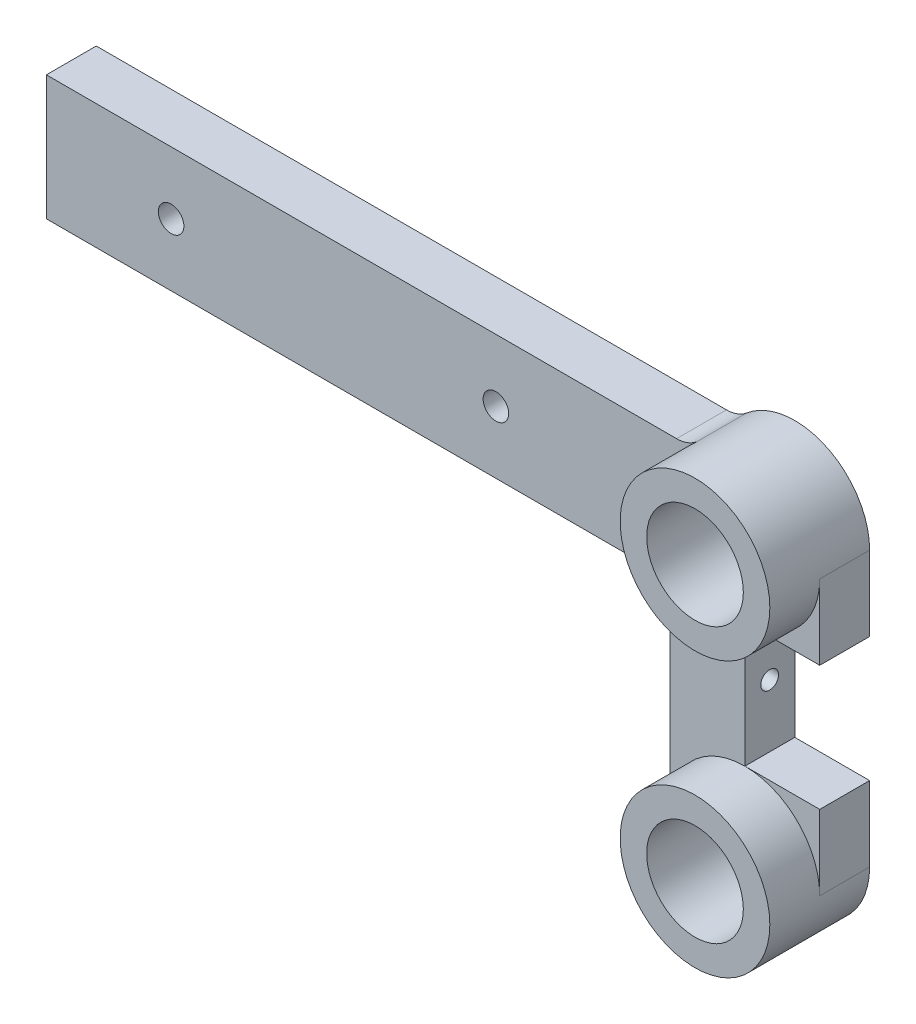
ISO-10303-21;
HEADER;
FILE_DESCRIPTION(('STEP AP214'),'2;1');
FILE_NAME('part.step','',(''),(''),'','','');
FILE_SCHEMA(('AUTOMOTIVE_DESIGN { 1 0 10303 214 1 1 1 1 }'));
ENDSEC;
DATA;
#1=APPLICATION_CONTEXT('core data for automotive mechanical design processes');
#2=APPLICATION_PROTOCOL_DEFINITION('international standard','automotive_design',2000,#1);
#3=PRODUCT_CONTEXT('',#1,'mechanical');
#4=PRODUCT('Part','Part','',(#3));
#5=PRODUCT_RELATED_PRODUCT_CATEGORY('part','',(#4));
#6=PRODUCT_DEFINITION_FORMATION('','',#4);
#7=PRODUCT_DEFINITION_CONTEXT('part definition',#1,'design');
#8=PRODUCT_DEFINITION('design','',#6,#7);
#9=PRODUCT_DEFINITION_SHAPE('','',#8);
#10=(LENGTH_UNIT() NAMED_UNIT(*) SI_UNIT(.MILLI.,.METRE.));
#11=(NAMED_UNIT(*) PLANE_ANGLE_UNIT() SI_UNIT($,.RADIAN.));
#12=(NAMED_UNIT(*) SI_UNIT($,.STERADIAN.) SOLID_ANGLE_UNIT());
#13=UNCERTAINTY_MEASURE_WITH_UNIT(LENGTH_MEASURE(1.E-05),#10,'distance_accuracy_value','');
#14=(GEOMETRIC_REPRESENTATION_CONTEXT(3) GLOBAL_UNCERTAINTY_ASSIGNED_CONTEXT((#13)) GLOBAL_UNIT_ASSIGNED_CONTEXT((#10,
#11,#12)) REPRESENTATION_CONTEXT('',''));
#15=CARTESIAN_POINT('',(0.,0.,0.));
#16=DIRECTION('',(0.,0.,1.));
#17=DIRECTION('',(1.,0.,0.));
#18=AXIS2_PLACEMENT_3D('',#15,#16,#17);
#19=CARTESIAN_POINT('',(0.,44.0000001788139,8.));
#20=DIRECTION('',(0.,0.,1.));
#21=DIRECTION('',(1.,0.,0.));
#22=AXIS2_PLACEMENT_3D('',#19,#20,#21);
#23=PLANE('',#22);
#24=CARTESIAN_POINT('',(-39.9238068438474,42.,8.));
#25=DIRECTION('',(0.,0.,1.));
#26=DIRECTION('',(1.,0.,0.));
#27=AXIS2_PLACEMENT_3D('',#24,#25,#26);
#28=CIRCLE('',#27,2.04999999999998);
#29=CARTESIAN_POINT('',(-37.8738068438474,42.,8.));
#30=VERTEX_POINT('',#29);
#31=EDGE_CURVE('E378',#30,#30,#28,.T.);
#32=ORIENTED_EDGE('',*,*,#31,.F.);
#33=EDGE_LOOP('',(#32));
#34=FACE_BOUND('',#33,.T.);
#35=CARTESIAN_POINT('',(-92.,42.,8.));
#36=DIRECTION('',(0.,0.,1.));
#37=DIRECTION('',(1.,0.,0.));
#38=AXIS2_PLACEMENT_3D('',#35,#36,#37);
#39=CIRCLE('',#38,2.04999999999998);
#40=CARTESIAN_POINT('',(-89.95,42.,8.));
#41=VERTEX_POINT('',#40);
#42=EDGE_CURVE('E390',#41,#41,#39,.T.);
#43=ORIENTED_EDGE('',*,*,#42,.F.);
#44=EDGE_LOOP('',(#43));
#45=FACE_BOUND('',#44,.T.);
#46=DIRECTION('',(-1.,0.,0.));
#47=VECTOR('',#46,1.);
#48=CARTESIAN_POINT('',(-7.,32.,8.));
#49=LINE('',#48,#47);
#50=CARTESIAN_POINT('',(-17.,32.,8.));
#51=VERTEX_POINT('',#50);
#52=CARTESIAN_POINT('',(-112.,32.,8.));
#53=VERTEX_POINT('',#52);
#54=EDGE_CURVE('E189',#51,#53,#49,.T.);
#55=ORIENTED_EDGE('',*,*,#54,.F.);
#56=CARTESIAN_POINT('',(-17.,27.,8.));
#57=DIRECTION('',(0.,0.,1.));
#58=DIRECTION('',(1.,0.,0.));
#59=AXIS2_PLACEMENT_3D('',#56,#57,#58);
#60=CIRCLE('',#59,5.);
#61=CARTESIAN_POINT('',(-12.,27.,8.));
#62=VERTEX_POINT('',#61);
#63=EDGE_CURVE('E45',#51,#62,#60,.F.);
#64=ORIENTED_EDGE('',*,*,#63,.T.);
#65=DIRECTION('',(0.,-1.,0.));
#66=VECTOR('',#65,1.);
#67=CARTESIAN_POINT('',(-12.,44.0000001788139,8.));
#68=LINE('',#67,#66);
#69=CARTESIAN_POINT('',(-12.,0.,8.));
#70=VERTEX_POINT('',#69);
#71=EDGE_CURVE('E141',#62,#70,#68,.T.);
#72=ORIENTED_EDGE('',*,*,#71,.T.);
#73=CARTESIAN_POINT('',(0.,0.,8.));
#74=DIRECTION('',(0.,0.,1.));
#75=DIRECTION('',(1.,0.,0.));
#76=AXIS2_PLACEMENT_3D('',#73,#74,#75);
#77=CIRCLE('',#76,12.);
#78=CARTESIAN_POINT('',(0.,12.,8.));
#79=VERTEX_POINT('',#78);
#80=EDGE_CURVE('E157',#79,#70,#77,.T.);
#81=ORIENTED_EDGE('',*,*,#80,.F.);
#82=DIRECTION('',(0.,1.,0.));
#83=VECTOR('',#82,1.);
#84=CARTESIAN_POINT('',(0.,12.,8.));
#85=LINE('',#84,#83);
#86=CARTESIAN_POINT('',(0.,32.,8.));
#87=VERTEX_POINT('',#86);
#88=EDGE_CURVE('E215',#79,#87,#85,.T.);
#89=ORIENTED_EDGE('',*,*,#88,.T.);
#90=CARTESIAN_POINT('',(0.,44.,8.));
#91=DIRECTION('',(0.,0.,1.));
#92=DIRECTION('',(1.,0.,0.));
#93=AXIS2_PLACEMENT_3D('',#90,#91,#92);
#94=CIRCLE('',#93,12.);
#95=CARTESIAN_POINT('',(-7.73255381469284,53.1764705362617,8.));
#96=VERTEX_POINT('',#95);
#97=EDGE_CURVE('E168',#96,#87,#94,.T.);
#98=ORIENTED_EDGE('',*,*,#97,.F.);
#99=CARTESIAN_POINT('',(-10.9544513623075,57.,8.));
#100=DIRECTION('',(0.,0.,1.));
#101=DIRECTION('',(1.,0.,0.));
#102=AXIS2_PLACEMENT_3D('',#99,#100,#101);
#103=CIRCLE('',#102,5.);
#104=CARTESIAN_POINT('',(-10.9544513623075,52.,8.));
#105=VERTEX_POINT('',#104);
#106=EDGE_CURVE('E247',#96,#105,#103,.F.);
#107=ORIENTED_EDGE('',*,*,#106,.T.);
#108=DIRECTION('',(-1.,0.,0.));
#109=VECTOR('',#108,1.);
#110=CARTESIAN_POINT('',(-7.,52.,8.));
#111=LINE('',#110,#109);
#112=CARTESIAN_POINT('',(-112.,52.,8.));
#113=VERTEX_POINT('',#112);
#114=EDGE_CURVE('E187',#105,#113,#111,.T.);
#115=ORIENTED_EDGE('',*,*,#114,.T.);
#116=DIRECTION('',(0.,1.,0.));
#117=VECTOR('',#116,1.);
#118=CARTESIAN_POINT('',(-112.,52.,8.));
#119=LINE('',#118,#117);
#120=EDGE_CURVE('E178',#53,#113,#119,.T.);
#121=ORIENTED_EDGE('',*,*,#120,.F.);
#122=EDGE_LOOP('',(#55,#64,#72,#81,#89,#98,#107,#115,#121));
#123=FACE_BOUND('',#122,.T.);
#124=ADVANCED_FACE('F37',(#34,#45,#123),#23,.T.);
#125=DIRECTION('',(-1.,0.,0.));
#126=VECTOR('',#125,1.);
#127=CARTESIAN_POINT('',(12.,12.,8.));
#128=LINE('',#127,#126);
#129=CARTESIAN_POINT('',(12.,12.,8.));
#130=VERTEX_POINT('',#129);
#131=EDGE_CURVE('E140',#130,#79,#128,.T.);
#132=ORIENTED_EDGE('',*,*,#131,.T.);
#133=CARTESIAN_POINT('',(12.,0.,8.));
#134=VERTEX_POINT('',#133);
#135=EDGE_CURVE('E149',#134,#79,#77,.T.);
#136=ORIENTED_EDGE('',*,*,#135,.F.);
#137=DIRECTION('',(0.,1.,0.));
#138=VECTOR('',#137,1.);
#139=CARTESIAN_POINT('',(12.,0.,8.));
#140=LINE('',#139,#138);
#141=EDGE_CURVE('E129',#134,#130,#140,.T.);
#142=ORIENTED_EDGE('',*,*,#141,.T.);
#143=EDGE_LOOP('',(#132,#136,#142));
#144=FACE_BOUND('',#143,.T.);
#145=ADVANCED_FACE('F155',(#144),#23,.T.);
#146=CARTESIAN_POINT('',(0.,44.0000001788139,0.));
#147=DIRECTION('',(0.,0.,1.));
#148=DIRECTION('',(1.,0.,0.));
#149=AXIS2_PLACEMENT_3D('',#146,#147,#148);
#150=CYLINDRICAL_SURFACE('',#149,12.);
#151=CARTESIAN_POINT('',(0.,44.0000001788139,0.));
#152=DIRECTION('',(0.,0.,1.));
#153=DIRECTION('',(1.,0.,0.));
#154=AXIS2_PLACEMENT_3D('',#151,#152,#153);
#155=CIRCLE('',#154,12.);
#156=CARTESIAN_POINT('',(12.,44.0000001788139,0.));
#157=VERTEX_POINT('',#156);
#158=CARTESIAN_POINT('',(-7.73255390280533,53.1764706408276,0.));
#159=VERTEX_POINT('',#158);
#160=EDGE_CURVE('E192',#157,#159,#155,.T.);
#161=ORIENTED_EDGE('',*,*,#160,.T.);
#162=DIRECTION('',(0.,0.,1.));
#163=VECTOR('',#162,1.);
#164=CARTESIAN_POINT('',(-7.73255390280533,53.1764706408276,0.));
#165=LINE('',#164,#163);
#166=EDGE_CURVE('E238',#159,#96,#165,.T.);
#167=ORIENTED_EDGE('',*,*,#166,.T.);
#168=ORIENTED_EDGE('',*,*,#97,.T.);
#169=CARTESIAN_POINT('',(12.,44.,8.));
#170=VERTEX_POINT('',#169);
#171=EDGE_CURVE('E172',#87,#170,#94,.T.);
#172=ORIENTED_EDGE('',*,*,#171,.T.);
#173=DIRECTION('',(0.,0.,1.));
#174=VECTOR('',#173,1.);
#175=CARTESIAN_POINT('',(12.,44.0000001788139,0.));
#176=LINE('',#175,#174);
#177=EDGE_CURVE('E222',#157,#170,#176,.T.);
#178=ORIENTED_EDGE('',*,*,#177,.F.);
#179=EDGE_LOOP('',(#161,#167,#168,#172,#178));
#180=FACE_BOUND('',#179,.T.);
#181=CARTESIAN_POINT('',(0.,44.,16.));
#182=DIRECTION('',(0.,0.,1.));
#183=DIRECTION('',(1.,0.,0.));
#184=AXIS2_PLACEMENT_3D('',#181,#182,#183);
#185=CIRCLE('',#184,12.);
#186=CARTESIAN_POINT('',(12.,44.,16.));
#187=VERTEX_POINT('',#186);
#188=EDGE_CURVE('E160',#187,#187,#185,.T.);
#189=ORIENTED_EDGE('',*,*,#188,.F.);
#190=EDGE_LOOP('',(#189));
#191=FACE_BOUND('',#190,.T.);
#192=ADVANCED_FACE('F265',(#180,#191),#150,.T.);
#193=CARTESIAN_POINT('',(12.,32.,0.));
#194=DIRECTION('',(1.,0.,0.));
#195=DIRECTION('',(0.,1.,0.));
#196=AXIS2_PLACEMENT_3D('',#193,#194,#195);
#197=PLANE('',#196);
#198=DIRECTION('',(0.,1.,0.));
#199=VECTOR('',#198,1.);
#200=CARTESIAN_POINT('',(12.,32.,8.));
#201=LINE('',#200,#199);
#202=CARTESIAN_POINT('',(12.,32.,8.));
#203=VERTEX_POINT('',#202);
#204=EDGE_CURVE('E196',#203,#170,#201,.T.);
#205=ORIENTED_EDGE('',*,*,#204,.F.);
#206=DIRECTION('',(0.,0.,1.));
#207=VECTOR('',#206,1.);
#208=CARTESIAN_POINT('',(12.,32.,0.));
#209=LINE('',#208,#207);
#210=CARTESIAN_POINT('',(12.,32.,0.));
#211=VERTEX_POINT('',#210);
#212=EDGE_CURVE('E225',#211,#203,#209,.T.);
#213=ORIENTED_EDGE('',*,*,#212,.F.);
#214=DIRECTION('',(0.,1.,0.));
#215=VECTOR('',#214,1.);
#216=CARTESIAN_POINT('',(12.,32.,0.));
#217=LINE('',#216,#215);
#218=EDGE_CURVE('E210',#211,#157,#217,.T.);
#219=ORIENTED_EDGE('',*,*,#218,.T.);
#220=ORIENTED_EDGE('',*,*,#177,.T.);
#221=EDGE_LOOP('',(#205,#213,#219,#220));
#222=FACE_BOUND('',#221,.T.);
#223=ADVANCED_FACE('F270',(#222),#197,.T.);
#224=CARTESIAN_POINT('',(0.,32.,0.));
#225=DIRECTION('',(0.,-1.,0.));
#226=DIRECTION('',(0.,0.,-1.));
#227=AXIS2_PLACEMENT_3D('',#224,#225,#226);
#228=PLANE('',#227);
#229=DIRECTION('',(1.,0.,0.));
#230=VECTOR('',#229,1.);
#231=CARTESIAN_POINT('',(0.,32.,8.));
#232=LINE('',#231,#230);
#233=EDGE_CURVE('E218',#87,#203,#232,.T.);
#234=ORIENTED_EDGE('',*,*,#233,.F.);
#235=DIRECTION('',(0.,0.,1.));
#236=VECTOR('',#235,1.);
#237=CARTESIAN_POINT('',(0.,32.,0.));
#238=LINE('',#237,#236);
#239=CARTESIAN_POINT('',(0.,32.,0.));
#240=VERTEX_POINT('',#239);
#241=EDGE_CURVE('E227',#240,#87,#238,.T.);
#242=ORIENTED_EDGE('',*,*,#241,.F.);
#243=DIRECTION('',(1.,0.,0.));
#244=VECTOR('',#243,1.);
#245=CARTESIAN_POINT('',(0.,32.,0.));
#246=LINE('',#245,#244);
#247=EDGE_CURVE('E207',#240,#211,#246,.T.);
#248=ORIENTED_EDGE('',*,*,#247,.T.);
#249=ORIENTED_EDGE('',*,*,#212,.T.);
#250=EDGE_LOOP('',(#234,#242,#248,#249));
#251=FACE_BOUND('',#250,.T.);
#252=ADVANCED_FACE('F321',(#251),#228,.T.);
#253=CARTESIAN_POINT('',(0.,12.,0.));
#254=DIRECTION('',(1.,0.,0.));
#255=DIRECTION('',(0.,1.,0.));
#256=AXIS2_PLACEMENT_3D('',#253,#254,#255);
#257=PLANE('',#256);
#258=CARTESIAN_POINT('',(0.,22.,4.02999031281051));
#259=DIRECTION('',(1.,0.,0.));
#260=DIRECTION('',(0.,0.,-1.));
#261=AXIS2_PLACEMENT_3D('',#258,#259,#260);
#262=CIRCLE('',#261,1.42499999999999);
#263=CARTESIAN_POINT('',(0.,22.,2.60499031281052));
#264=VERTEX_POINT('',#263);
#265=EDGE_CURVE('E405',#264,#264,#262,.T.);
#266=ORIENTED_EDGE('',*,*,#265,.F.);
#267=EDGE_LOOP('',(#266));
#268=FACE_BOUND('',#267,.T.);
#269=ORIENTED_EDGE('',*,*,#88,.F.);
#270=DIRECTION('',(0.,0.,1.));
#271=VECTOR('',#270,1.);
#272=CARTESIAN_POINT('',(0.,12.,0.));
#273=LINE('',#272,#271);
#274=CARTESIAN_POINT('',(0.,12.,0.));
#275=VERTEX_POINT('',#274);
#276=EDGE_CURVE('E230',#275,#79,#273,.T.);
#277=ORIENTED_EDGE('',*,*,#276,.F.);
#278=DIRECTION('',(0.,1.,0.));
#279=VECTOR('',#278,1.);
#280=CARTESIAN_POINT('',(0.,12.,0.));
#281=LINE('',#280,#279);
#282=EDGE_CURVE('E204',#275,#240,#281,.T.);
#283=ORIENTED_EDGE('',*,*,#282,.T.);
#284=ORIENTED_EDGE('',*,*,#241,.T.);
#285=EDGE_LOOP('',(#269,#277,#283,#284));
#286=FACE_BOUND('',#285,.T.);
#287=ADVANCED_FACE('F277',(#268,#286),#257,.T.);
#288=CARTESIAN_POINT('',(12.,12.,0.));
#289=DIRECTION('',(0.,1.,0.));
#290=DIRECTION('',(0.,0.,1.));
#291=AXIS2_PLACEMENT_3D('',#288,#289,#290);
#292=PLANE('',#291);
#293=ORIENTED_EDGE('',*,*,#131,.F.);
#294=DIRECTION('',(0.,0.,1.));
#295=VECTOR('',#294,1.);
#296=CARTESIAN_POINT('',(12.,12.,0.));
#297=LINE('',#296,#295);
#298=CARTESIAN_POINT('',(12.,12.,0.));
#299=VERTEX_POINT('',#298);
#300=EDGE_CURVE('E135',#299,#130,#297,.T.);
#301=ORIENTED_EDGE('',*,*,#300,.F.);
#302=DIRECTION('',(-1.,0.,0.));
#303=VECTOR('',#302,1.);
#304=CARTESIAN_POINT('',(12.,12.,0.));
#305=LINE('',#304,#303);
#306=EDGE_CURVE('E201',#299,#275,#305,.T.);
#307=ORIENTED_EDGE('',*,*,#306,.T.);
#308=ORIENTED_EDGE('',*,*,#276,.T.);
#309=EDGE_LOOP('',(#293,#301,#307,#308));
#310=FACE_BOUND('',#309,.T.);
#311=ADVANCED_FACE('F280',(#310),#292,.T.);
#312=CARTESIAN_POINT('',(12.,0.,0.));
#313=DIRECTION('',(1.,0.,0.));
#314=DIRECTION('',(0.,0.,-1.));
#315=AXIS2_PLACEMENT_3D('',#312,#313,#314);
#316=PLANE('',#315);
#317=ORIENTED_EDGE('',*,*,#141,.F.);
#318=DIRECTION('',(0.,0.,1.));
#319=VECTOR('',#318,1.);
#320=CARTESIAN_POINT('',(12.,0.,0.));
#321=LINE('',#320,#319);
#322=CARTESIAN_POINT('',(12.,0.,0.));
#323=VERTEX_POINT('',#322);
#324=EDGE_CURVE('E133',#323,#134,#321,.T.);
#325=ORIENTED_EDGE('',*,*,#324,.F.);
#326=DIRECTION('',(0.,1.,0.));
#327=VECTOR('',#326,1.);
#328=CARTESIAN_POINT('',(12.,0.,0.));
#329=LINE('',#328,#327);
#330=EDGE_CURVE('E199',#323,#299,#329,.T.);
#331=ORIENTED_EDGE('',*,*,#330,.T.);
#332=ORIENTED_EDGE('',*,*,#300,.T.);
#333=EDGE_LOOP('',(#317,#325,#331,#332));
#334=FACE_BOUND('',#333,.T.);
#335=ADVANCED_FACE('F131',(#334),#316,.T.);
#336=CARTESIAN_POINT('',(0.,0.,0.));
#337=DIRECTION('',(0.,0.,1.));
#338=DIRECTION('',(1.,0.,0.));
#339=AXIS2_PLACEMENT_3D('',#336,#337,#338);
#340=CYLINDRICAL_SURFACE('',#339,12.);
#341=ORIENTED_EDGE('',*,*,#324,.T.);
#342=ORIENTED_EDGE('',*,*,#135,.T.);
#343=ORIENTED_EDGE('',*,*,#80,.T.);
#344=DIRECTION('',(0.,0.,1.));
#345=VECTOR('',#344,1.);
#346=CARTESIAN_POINT('',(-12.,0.,0.));
#347=LINE('',#346,#345);
#348=CARTESIAN_POINT('',(-12.,0.,0.));
#349=VERTEX_POINT('',#348);
#350=EDGE_CURVE('E153',#349,#70,#347,.T.);
#351=ORIENTED_EDGE('',*,*,#350,.F.);
#352=CARTESIAN_POINT('',(0.,0.,0.));
#353=DIRECTION('',(0.,0.,1.));
#354=DIRECTION('',(1.,0.,0.));
#355=AXIS2_PLACEMENT_3D('',#352,#353,#354);
#356=CIRCLE('',#355,12.);
#357=EDGE_CURVE('E152',#349,#323,#356,.T.);
#358=ORIENTED_EDGE('',*,*,#357,.T.);
#359=EDGE_LOOP('',(#341,#342,#343,#351,#358));
#360=FACE_BOUND('',#359,.T.);
#361=CARTESIAN_POINT('',(0.,0.,16.));
#362=DIRECTION('',(0.,0.,1.));
#363=DIRECTION('',(1.,0.,0.));
#364=AXIS2_PLACEMENT_3D('',#361,#362,#363);
#365=CIRCLE('',#364,12.);
#366=CARTESIAN_POINT('',(12.,0.,16.));
#367=VERTEX_POINT('',#366);
#368=EDGE_CURVE('E156',#367,#367,#365,.T.);
#369=ORIENTED_EDGE('',*,*,#368,.F.);
#370=EDGE_LOOP('',(#369));
#371=FACE_BOUND('',#370,.T.);
#372=ADVANCED_FACE('F146',(#360,#371),#340,.T.);
#373=CARTESIAN_POINT('',(-12.,44.0000001788139,0.));
#374=DIRECTION('',(-1.,0.,0.));
#375=DIRECTION('',(0.,0.,1.));
#376=AXIS2_PLACEMENT_3D('',#373,#374,#375);
#377=PLANE('',#376);
#378=ORIENTED_EDGE('',*,*,#71,.F.);
#379=DIRECTION('',(0.,0.,1.));
#380=VECTOR('',#379,1.);
#381=CARTESIAN_POINT('',(-12.,27.,0.));
#382=LINE('',#381,#380);
#383=CARTESIAN_POINT('',(-12.,27.,0.));
#384=VERTEX_POINT('',#383);
#385=EDGE_CURVE('E58',#62,#384,#382,.F.);
#386=ORIENTED_EDGE('',*,*,#385,.T.);
#387=DIRECTION('',(0.,-1.,0.));
#388=VECTOR('',#387,1.);
#389=CARTESIAN_POINT('',(-12.,44.0000001788139,0.));
#390=LINE('',#389,#388);
#391=EDGE_CURVE('E195',#384,#349,#390,.T.);
#392=ORIENTED_EDGE('',*,*,#391,.T.);
#393=ORIENTED_EDGE('',*,*,#350,.T.);
#394=EDGE_LOOP('',(#378,#386,#392,#393));
#395=FACE_BOUND('',#394,.T.);
#396=ADVANCED_FACE('F319',(#395),#377,.T.);
#397=CARTESIAN_POINT('',(0.,44.0000001788139,0.));
#398=DIRECTION('',(0.,0.,1.));
#399=DIRECTION('',(1.,0.,0.));
#400=AXIS2_PLACEMENT_3D('',#397,#398,#399);
#401=PLANE('',#400);
#402=CARTESIAN_POINT('',(0.,44.,0.));
#403=DIRECTION('',(0.,0.,1.));
#404=DIRECTION('',(1.,0.,0.));
#405=AXIS2_PLACEMENT_3D('',#402,#403,#404);
#406=CIRCLE('',#405,7.75);
#407=CARTESIAN_POINT('',(7.75,44.,0.));
#408=VERTEX_POINT('',#407);
#409=EDGE_CURVE('E375',#408,#408,#406,.T.);
#410=ORIENTED_EDGE('',*,*,#409,.T.);
#411=EDGE_LOOP('',(#410));
#412=FACE_BOUND('',#411,.T.);
#413=CARTESIAN_POINT('',(0.,0.,0.));
#414=DIRECTION('',(0.,0.,1.));
#415=DIRECTION('',(1.,0.,0.));
#416=AXIS2_PLACEMENT_3D('',#413,#414,#415);
#417=CIRCLE('',#416,7.75);
#418=CARTESIAN_POINT('',(7.75,0.,0.));
#419=VERTEX_POINT('',#418);
#420=EDGE_CURVE('E374',#419,#419,#417,.T.);
#421=ORIENTED_EDGE('',*,*,#420,.T.);
#422=EDGE_LOOP('',(#421));
#423=FACE_BOUND('',#422,.T.);
#424=CARTESIAN_POINT('',(-39.9238068438474,42.,0.));
#425=DIRECTION('',(0.,0.,1.));
#426=DIRECTION('',(1.,0.,0.));
#427=AXIS2_PLACEMENT_3D('',#424,#425,#426);
#428=CIRCLE('',#427,2.04999999999998);
#429=CARTESIAN_POINT('',(-37.8738068438474,42.,0.));
#430=VERTEX_POINT('',#429);
#431=EDGE_CURVE('E387',#430,#430,#428,.T.);
#432=ORIENTED_EDGE('',*,*,#431,.T.);
#433=EDGE_LOOP('',(#432));
#434=FACE_BOUND('',#433,.T.);
#435=CARTESIAN_POINT('',(-92.,42.,0.));
#436=DIRECTION('',(0.,0.,1.));
#437=DIRECTION('',(1.,0.,0.));
#438=AXIS2_PLACEMENT_3D('',#435,#436,#437);
#439=CIRCLE('',#438,2.04999999999998);
#440=CARTESIAN_POINT('',(-89.95,42.,0.));
#441=VERTEX_POINT('',#440);
#442=EDGE_CURVE('E162',#441,#441,#439,.T.);
#443=ORIENTED_EDGE('',*,*,#442,.T.);
#444=EDGE_LOOP('',(#443));
#445=FACE_BOUND('',#444,.T.);
#446=DIRECTION('',(-1.,0.,0.));
#447=VECTOR('',#446,1.);
#448=CARTESIAN_POINT('',(-7.,52.,0.));
#449=LINE('',#448,#447);
#450=CARTESIAN_POINT('',(-10.9544513623075,52.,0.));
#451=VERTEX_POINT('',#450);
#452=CARTESIAN_POINT('',(-112.,52.,0.));
#453=VERTEX_POINT('',#452);
#454=EDGE_CURVE('E185',#451,#453,#449,.T.);
#455=ORIENTED_EDGE('',*,*,#454,.F.);
#456=CARTESIAN_POINT('',(-10.9544513623075,57.,0.));
#457=DIRECTION('',(0.,0.,1.));
#458=DIRECTION('',(1.,0.,0.));
#459=AXIS2_PLACEMENT_3D('',#456,#457,#458);
#460=CIRCLE('',#459,5.);
#461=EDGE_CURVE('E245',#451,#159,#460,.T.);
#462=ORIENTED_EDGE('',*,*,#461,.T.);
#463=ORIENTED_EDGE('',*,*,#160,.F.);
#464=ORIENTED_EDGE('',*,*,#218,.F.);
#465=ORIENTED_EDGE('',*,*,#247,.F.);
#466=ORIENTED_EDGE('',*,*,#282,.F.);
#467=ORIENTED_EDGE('',*,*,#306,.F.);
#468=ORIENTED_EDGE('',*,*,#330,.F.);
#469=ORIENTED_EDGE('',*,*,#357,.F.);
#470=ORIENTED_EDGE('',*,*,#391,.F.);
#471=CARTESIAN_POINT('',(-17.,27.,0.));
#472=DIRECTION('',(0.,0.,1.));
#473=DIRECTION('',(1.,0.,0.));
#474=AXIS2_PLACEMENT_3D('',#471,#472,#473);
#475=CIRCLE('',#474,5.);
#476=CARTESIAN_POINT('',(-17.,32.,0.));
#477=VERTEX_POINT('',#476);
#478=EDGE_CURVE('E11',#384,#477,#475,.T.);
#479=ORIENTED_EDGE('',*,*,#478,.T.);
#480=DIRECTION('',(-1.,0.,0.));
#481=VECTOR('',#480,1.);
#482=CARTESIAN_POINT('',(-7.,32.,0.));
#483=LINE('',#482,#481);
#484=CARTESIAN_POINT('',(-112.,32.,0.));
#485=VERTEX_POINT('',#484);
#486=EDGE_CURVE('E184',#477,#485,#483,.T.);
#487=ORIENTED_EDGE('',*,*,#486,.T.);
#488=DIRECTION('',(0.,-1.,0.));
#489=VECTOR('',#488,1.);
#490=CARTESIAN_POINT('',(-112.,52.,0.));
#491=LINE('',#490,#489);
#492=EDGE_CURVE('E167',#453,#485,#491,.T.);
#493=ORIENTED_EDGE('',*,*,#492,.F.);
#494=EDGE_LOOP('',(#455,#462,#463,#464,#465,#466,#467,#468,#469,#470,#479,#487,#493));
#495=FACE_BOUND('',#494,.T.);
#496=ADVANCED_FACE('F261',(#412,#423,#434,#445,#495),#401,.F.);
#497=ORIENTED_EDGE('',*,*,#171,.F.);
#498=ORIENTED_EDGE('',*,*,#233,.T.);
#499=ORIENTED_EDGE('',*,*,#204,.T.);
#500=EDGE_LOOP('',(#497,#498,#499));
#501=FACE_BOUND('',#500,.T.);
#502=ADVANCED_FACE('F305',(#501),#23,.T.);
#503=CARTESIAN_POINT('',(-7.,52.,0.));
#504=DIRECTION('',(0.,1.,0.));
#505=DIRECTION('',(0.,0.,1.));
#506=AXIS2_PLACEMENT_3D('',#503,#504,#505);
#507=PLANE('',#506);
#508=ORIENTED_EDGE('',*,*,#114,.F.);
#509=DIRECTION('',(0.,0.,-1.));
#510=VECTOR('',#509,1.);
#511=CARTESIAN_POINT('',(-10.9544513623075,52.,0.));
#512=LINE('',#511,#510);
#513=EDGE_CURVE('E171',#105,#451,#512,.T.);
#514=ORIENTED_EDGE('',*,*,#513,.T.);
#515=ORIENTED_EDGE('',*,*,#454,.T.);
#516=DIRECTION('',(0.,0.,-1.));
#517=VECTOR('',#516,1.);
#518=CARTESIAN_POINT('',(-112.,52.,0.));
#519=LINE('',#518,#517);
#520=EDGE_CURVE('E181',#113,#453,#519,.T.);
#521=ORIENTED_EDGE('',*,*,#520,.F.);
#522=EDGE_LOOP('',(#508,#514,#515,#521));
#523=FACE_BOUND('',#522,.T.);
#524=ADVANCED_FACE('F256',(#523),#507,.T.);
#525=CARTESIAN_POINT('',(-7.,32.,0.));
#526=DIRECTION('',(0.,-1.,0.));
#527=DIRECTION('',(0.,0.,-1.));
#528=AXIS2_PLACEMENT_3D('',#525,#526,#527);
#529=PLANE('',#528);
#530=ORIENTED_EDGE('',*,*,#486,.F.);
#531=DIRECTION('',(0.,0.,1.));
#532=VECTOR('',#531,1.);
#533=CARTESIAN_POINT('',(-17.,32.,8.));
#534=LINE('',#533,#532);
#535=EDGE_CURVE('E241',#477,#51,#534,.T.);
#536=ORIENTED_EDGE('',*,*,#535,.T.);
#537=ORIENTED_EDGE('',*,*,#54,.T.);
#538=DIRECTION('',(0.,0.,1.));
#539=VECTOR('',#538,1.);
#540=CARTESIAN_POINT('',(-112.,32.,0.));
#541=LINE('',#540,#539);
#542=EDGE_CURVE('E175',#485,#53,#541,.T.);
#543=ORIENTED_EDGE('',*,*,#542,.F.);
#544=EDGE_LOOP('',(#530,#536,#537,#543));
#545=FACE_BOUND('',#544,.T.);
#546=ADVANCED_FACE('F286',(#545),#529,.T.);
#547=CARTESIAN_POINT('',(-112.,0.,0.));
#548=DIRECTION('',(-1.,0.,0.));
#549=DIRECTION('',(0.,0.,1.));
#550=AXIS2_PLACEMENT_3D('',#547,#548,#549);
#551=PLANE('',#550);
#552=ORIENTED_EDGE('',*,*,#492,.T.);
#553=ORIENTED_EDGE('',*,*,#542,.T.);
#554=ORIENTED_EDGE('',*,*,#120,.T.);
#555=ORIENTED_EDGE('',*,*,#520,.T.);
#556=EDGE_LOOP('',(#552,#553,#554,#555));
#557=FACE_BOUND('',#556,.T.);
#558=ADVANCED_FACE('F289',(#557),#551,.T.);
#559=CARTESIAN_POINT('',(0.,44.,16.));
#560=DIRECTION('',(0.,0.,1.));
#561=DIRECTION('',(1.,0.,0.));
#562=AXIS2_PLACEMENT_3D('',#559,#560,#561);
#563=PLANE('',#562);
#564=CARTESIAN_POINT('',(0.,44.,16.));
#565=DIRECTION('',(0.,0.,1.));
#566=DIRECTION('',(1.,0.,0.));
#567=AXIS2_PLACEMENT_3D('',#564,#565,#566);
#568=CIRCLE('',#567,7.74999999999999);
#569=CARTESIAN_POINT('',(7.74999999999999,44.,16.));
#570=VERTEX_POINT('',#569);
#571=EDGE_CURVE('E381',#570,#570,#568,.T.);
#572=ORIENTED_EDGE('',*,*,#571,.F.);
#573=EDGE_LOOP('',(#572));
#574=FACE_BOUND('',#573,.T.);
#575=ORIENTED_EDGE('',*,*,#188,.T.);
#576=EDGE_LOOP('',(#575));
#577=FACE_BOUND('',#576,.T.);
#578=ADVANCED_FACE('F291',(#574,#577),#563,.T.);
#579=CARTESIAN_POINT('',(0.,0.,16.));
#580=DIRECTION('',(0.,0.,1.));
#581=DIRECTION('',(1.,0.,0.));
#582=AXIS2_PLACEMENT_3D('',#579,#580,#581);
#583=PLANE('',#582);
#584=CARTESIAN_POINT('',(0.,0.,16.));
#585=DIRECTION('',(0.,0.,1.));
#586=DIRECTION('',(1.,0.,0.));
#587=AXIS2_PLACEMENT_3D('',#584,#585,#586);
#588=CIRCLE('',#587,7.74999999999999);
#589=CARTESIAN_POINT('',(7.74999999999999,0.,16.));
#590=VERTEX_POINT('',#589);
#591=EDGE_CURVE('E371',#590,#590,#588,.T.);
#592=ORIENTED_EDGE('',*,*,#591,.F.);
#593=EDGE_LOOP('',(#592));
#594=FACE_BOUND('',#593,.T.);
#595=ORIENTED_EDGE('',*,*,#368,.T.);
#596=EDGE_LOOP('',(#595));
#597=FACE_BOUND('',#596,.T.);
#598=ADVANCED_FACE('F297',(#594,#597),#583,.T.);
#599=CARTESIAN_POINT('',(-92.,42.,8.));
#600=DIRECTION('',(0.,0.,1.));
#601=DIRECTION('',(1.,0.,0.));
#602=AXIS2_PLACEMENT_3D('',#599,#600,#601);
#603=CYLINDRICAL_SURFACE('',#602,2.04999999999998);
#604=ORIENTED_EDGE('',*,*,#442,.F.);
#605=EDGE_LOOP('',(#604));
#606=FACE_BOUND('',#605,.T.);
#607=ORIENTED_EDGE('',*,*,#42,.T.);
#608=EDGE_LOOP('',(#607));
#609=FACE_BOUND('',#608,.T.);
#610=ADVANCED_FACE('F359',(#606,#609),#603,.F.);
#611=CARTESIAN_POINT('',(-39.9238068438474,42.,8.));
#612=DIRECTION('',(0.,0.,1.));
#613=DIRECTION('',(1.,0.,0.));
#614=AXIS2_PLACEMENT_3D('',#611,#612,#613);
#615=CYLINDRICAL_SURFACE('',#614,2.04999999999998);
#616=ORIENTED_EDGE('',*,*,#431,.F.);
#617=EDGE_LOOP('',(#616));
#618=FACE_BOUND('',#617,.T.);
#619=ORIENTED_EDGE('',*,*,#31,.T.);
#620=EDGE_LOOP('',(#619));
#621=FACE_BOUND('',#620,.T.);
#622=ADVANCED_FACE('F355',(#618,#621),#615,.F.);
#623=CARTESIAN_POINT('',(0.,0.,16.));
#624=DIRECTION('',(0.,0.,1.));
#625=DIRECTION('',(1.,0.,0.));
#626=AXIS2_PLACEMENT_3D('',#623,#624,#625);
#627=CYLINDRICAL_SURFACE('',#626,7.74999999999999);
#628=ORIENTED_EDGE('',*,*,#420,.F.);
#629=EDGE_LOOP('',(#628));
#630=FACE_BOUND('',#629,.T.);
#631=ORIENTED_EDGE('',*,*,#591,.T.);
#632=EDGE_LOOP('',(#631));
#633=FACE_BOUND('',#632,.T.);
#634=ADVANCED_FACE('F351',(#630,#633),#627,.F.);
#635=CARTESIAN_POINT('',(0.,44.,16.));
#636=DIRECTION('',(0.,0.,1.));
#637=DIRECTION('',(1.,0.,0.));
#638=AXIS2_PLACEMENT_3D('',#635,#636,#637);
#639=CYLINDRICAL_SURFACE('',#638,7.74999999999999);
#640=ORIENTED_EDGE('',*,*,#409,.F.);
#641=EDGE_LOOP('',(#640));
#642=FACE_BOUND('',#641,.T.);
#643=ORIENTED_EDGE('',*,*,#571,.T.);
#644=EDGE_LOOP('',(#643));
#645=FACE_BOUND('',#644,.T.);
#646=ADVANCED_FACE('F343',(#642,#645),#639,.F.);
#647=CARTESIAN_POINT('',(-9.99999999999999,22.,4.02999031281051));
#648=DIRECTION('',(-1.,0.,0.));
#649=DIRECTION('',(0.,0.,1.));
#650=AXIS2_PLACEMENT_3D('',#647,#648,#649);
#651=PLANE('',#650);
#652=CARTESIAN_POINT('',(-9.99999999999999,22.,4.02999031281051));
#653=DIRECTION('',(1.,0.,0.));
#654=DIRECTION('',(0.,0.,-1.));
#655=AXIS2_PLACEMENT_3D('',#652,#653,#654);
#656=CIRCLE('',#655,1.42499999999999);
#657=CARTESIAN_POINT('',(-9.99999999999999,22.,2.60499031281052));
#658=VERTEX_POINT('',#657);
#659=EDGE_CURVE('E402',#658,#658,#656,.T.);
#660=ORIENTED_EDGE('',*,*,#659,.T.);
#661=EDGE_LOOP('',(#660));
#662=FACE_BOUND('',#661,.T.);
#663=ADVANCED_FACE('F337',(#662),#651,.F.);
#664=CARTESIAN_POINT('',(0.,22.,4.02999031281051));
#665=DIRECTION('',(1.,0.,0.));
#666=DIRECTION('',(0.,0.,-1.));
#667=AXIS2_PLACEMENT_3D('',#664,#665,#666);
#668=CYLINDRICAL_SURFACE('',#667,1.42499999999999);
#669=ORIENTED_EDGE('',*,*,#659,.F.);
#670=EDGE_LOOP('',(#669));
#671=FACE_BOUND('',#670,.T.);
#672=ORIENTED_EDGE('',*,*,#265,.T.);
#673=EDGE_LOOP('',(#672));
#674=FACE_BOUND('',#673,.T.);
#675=ADVANCED_FACE('F332',(#671,#674),#668,.F.);
#676=CARTESIAN_POINT('',(-10.9544513623075,57.,0.));
#677=DIRECTION('',(0.,0.,1.));
#678=DIRECTION('',(1.,0.,0.));
#679=AXIS2_PLACEMENT_3D('',#676,#677,#678);
#680=CYLINDRICAL_SURFACE('',#679,5.);
#681=ORIENTED_EDGE('',*,*,#106,.F.);
#682=ORIENTED_EDGE('',*,*,#166,.F.);
#683=ORIENTED_EDGE('',*,*,#461,.F.);
#684=ORIENTED_EDGE('',*,*,#513,.F.);
#685=EDGE_LOOP('',(#681,#682,#683,#684));
#686=FACE_BOUND('',#685,.T.);
#687=ADVANCED_FACE('F258',(#686),#680,.F.);
#688=CARTESIAN_POINT('',(-17.,27.,0.));
#689=DIRECTION('',(0.,0.,-1.));
#690=DIRECTION('',(-1.,0.,0.));
#691=AXIS2_PLACEMENT_3D('',#688,#689,#690);
#692=CYLINDRICAL_SURFACE('',#691,5.);
#693=ORIENTED_EDGE('',*,*,#478,.F.);
#694=ORIENTED_EDGE('',*,*,#385,.F.);
#695=ORIENTED_EDGE('',*,*,#63,.F.);
#696=ORIENTED_EDGE('',*,*,#535,.F.);
#697=EDGE_LOOP('',(#693,#694,#695,#696));
#698=FACE_BOUND('',#697,.T.);
#699=ADVANCED_FACE('F39',(#698),#692,.F.);
#700=CLOSED_SHELL('',(#124,#145,#192,#223,#252,#287,#311,#335,#372,#396,#496,#502,#524,#546,
#558,#578,#598,#610,#622,#634,#646,#663,#675,#687,#699));
#701=MANIFOLD_SOLID_BREP('B2',#700);
#702=ADVANCED_BREP_SHAPE_REPRESENTATION('',(#18,#701),#14);
#703=SHAPE_DEFINITION_REPRESENTATION(#9,#702);
ENDSEC;
END-ISO-10303-21;
